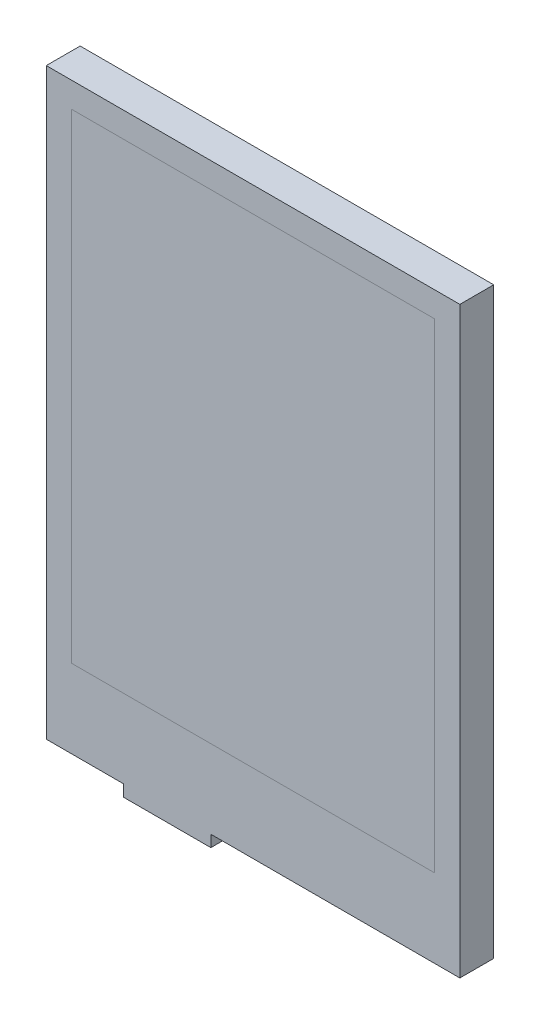
ISO-10303-21;
HEADER;
FILE_DESCRIPTION(('STEP AP214'),'2;1');
FILE_NAME('part.step','',(''),(''),'','','');
FILE_SCHEMA(('AUTOMOTIVE_DESIGN { 1 0 10303 214 1 1 1 1 }'));
ENDSEC;
DATA;
#1=APPLICATION_CONTEXT('core data for automotive mechanical design processes');
#2=APPLICATION_PROTOCOL_DEFINITION('international standard','automotive_design',2000,#1);
#3=PRODUCT_CONTEXT('',#1,'mechanical');
#4=PRODUCT('Part','Part','',(#3));
#5=PRODUCT_RELATED_PRODUCT_CATEGORY('part','',(#4));
#6=PRODUCT_DEFINITION_FORMATION('','',#4);
#7=PRODUCT_DEFINITION_CONTEXT('part definition',#1,'design');
#8=PRODUCT_DEFINITION('design','',#6,#7);
#9=PRODUCT_DEFINITION_SHAPE('','',#8);
#10=(LENGTH_UNIT() NAMED_UNIT(*) SI_UNIT(.MILLI.,.METRE.));
#11=(NAMED_UNIT(*) PLANE_ANGLE_UNIT() SI_UNIT($,.RADIAN.));
#12=(NAMED_UNIT(*) SI_UNIT($,.STERADIAN.) SOLID_ANGLE_UNIT());
#13=UNCERTAINTY_MEASURE_WITH_UNIT(LENGTH_MEASURE(1.E-05),#10,'distance_accuracy_value','');
#14=(GEOMETRIC_REPRESENTATION_CONTEXT(3) GLOBAL_UNCERTAINTY_ASSIGNED_CONTEXT((#13)) GLOBAL_UNIT_ASSIGNED_CONTEXT((#10,
#11,#12)) REPRESENTATION_CONTEXT('',''));
#15=CARTESIAN_POINT('',(0.,0.,0.));
#16=DIRECTION('',(0.,0.,1.));
#17=DIRECTION('',(1.,0.,0.));
#18=AXIS2_PLACEMENT_3D('',#15,#16,#17);
#19=CARTESIAN_POINT('',(-13.1,0.,0.3));
#20=DIRECTION('',(1.,0.,0.));
#21=DIRECTION('',(0.,1.,0.));
#22=AXIS2_PLACEMENT_3D('',#19,#20,#21);
#23=PLANE('',#22);
#24=DIRECTION('',(0.,-1.,0.));
#25=VECTOR('',#24,1.);
#26=CARTESIAN_POINT('',(-13.1,0.,0.));
#27=LINE('',#26,#25);
#28=CARTESIAN_POINT('',(-13.1,0.019999999999995,0.));
#29=VERTEX_POINT('',#28);
#30=CARTESIAN_POINT('',(-13.1,-9.48000000000001,0.));
#31=VERTEX_POINT('',#30);
#32=EDGE_CURVE('E110',#29,#31,#27,.T.);
#33=ORIENTED_EDGE('',*,*,#32,.F.);
#34=DIRECTION('',(0.,0.,-1.));
#35=VECTOR('',#34,1.);
#36=CARTESIAN_POINT('',(-13.1,0.019999999999995,0.3));
#37=LINE('',#36,#35);
#38=CARTESIAN_POINT('',(-13.1,0.019999999999995,0.3));
#39=VERTEX_POINT('',#38);
#40=EDGE_CURVE('E12',#39,#29,#37,.T.);
#41=ORIENTED_EDGE('',*,*,#40,.F.);
#42=DIRECTION('',(0.,-1.,0.));
#43=VECTOR('',#42,1.);
#44=CARTESIAN_POINT('',(-13.1,0.,0.3));
#45=LINE('',#44,#43);
#46=CARTESIAN_POINT('',(-13.1,-9.48000000000001,0.3));
#47=VERTEX_POINT('',#46);
#48=EDGE_CURVE('E98',#39,#47,#45,.T.);
#49=ORIENTED_EDGE('',*,*,#48,.T.);
#50=DIRECTION('',(0.,0.,-1.));
#51=VECTOR('',#50,1.);
#52=CARTESIAN_POINT('',(-13.1,-9.48000000000001,0.3));
#53=LINE('',#52,#51);
#54=EDGE_CURVE('E87',#47,#31,#53,.T.);
#55=ORIENTED_EDGE('',*,*,#54,.T.);
#56=EDGE_LOOP('',(#33,#41,#49,#55));
#57=FACE_BOUND('',#56,.T.);
#58=ADVANCED_FACE('F48',(#57),#23,.T.);
#59=CARTESIAN_POINT('',(0.,0.0199999999999966,0.3));
#60=DIRECTION('',(0.,-1.,0.));
#61=DIRECTION('',(1.,0.,0.));
#62=AXIS2_PLACEMENT_3D('',#59,#60,#61);
#63=PLANE('',#62);
#64=DIRECTION('',(-1.,0.,0.));
#65=VECTOR('',#64,1.);
#66=CARTESIAN_POINT('',(0.,0.0199999999999966,0.));
#67=LINE('',#66,#65);
#68=CARTESIAN_POINT('',(-17.,0.0199999999999945,0.));
#69=VERTEX_POINT('',#68);
#70=EDGE_CURVE('E103',#29,#69,#67,.T.);
#71=ORIENTED_EDGE('',*,*,#70,.T.);
#72=DIRECTION('',(0.,0.,-1.));
#73=VECTOR('',#72,1.);
#74=CARTESIAN_POINT('',(-17.,0.0199999999999945,0.3));
#75=LINE('',#74,#73);
#76=CARTESIAN_POINT('',(-17.,0.0199999999999945,0.3));
#77=VERTEX_POINT('',#76);
#78=EDGE_CURVE('E56',#77,#69,#75,.T.);
#79=ORIENTED_EDGE('',*,*,#78,.F.);
#80=DIRECTION('',(-1.,0.,0.));
#81=VECTOR('',#80,1.);
#82=CARTESIAN_POINT('',(0.,0.0199999999999966,0.3));
#83=LINE('',#82,#81);
#84=EDGE_CURVE('E93',#39,#77,#83,.T.);
#85=ORIENTED_EDGE('',*,*,#84,.F.);
#86=ORIENTED_EDGE('',*,*,#40,.T.);
#87=EDGE_LOOP('',(#71,#79,#85,#86));
#88=FACE_BOUND('',#87,.T.);
#89=ADVANCED_FACE('F101',(#88),#63,.F.);
#90=CARTESIAN_POINT('',(-17.,0.,0.3));
#91=DIRECTION('',(1.,0.,0.));
#92=DIRECTION('',(0.,1.,0.));
#93=AXIS2_PLACEMENT_3D('',#90,#91,#92);
#94=PLANE('',#93);
#95=DIRECTION('',(0.,-1.,0.));
#96=VECTOR('',#95,1.);
#97=CARTESIAN_POINT('',(-17.,0.,0.));
#98=LINE('',#97,#96);
#99=CARTESIAN_POINT('',(-17.,-9.48000000000001,0.));
#100=VERTEX_POINT('',#99);
#101=EDGE_CURVE('E80',#69,#100,#98,.T.);
#102=ORIENTED_EDGE('',*,*,#101,.T.);
#103=DIRECTION('',(0.,0.,-1.));
#104=VECTOR('',#103,1.);
#105=CARTESIAN_POINT('',(-17.,-9.48000000000001,0.3));
#106=LINE('',#105,#104);
#107=CARTESIAN_POINT('',(-17.,-9.48000000000001,0.3));
#108=VERTEX_POINT('',#107);
#109=EDGE_CURVE('E104',#108,#100,#106,.T.);
#110=ORIENTED_EDGE('',*,*,#109,.F.);
#111=DIRECTION('',(0.,-1.,0.));
#112=VECTOR('',#111,1.);
#113=CARTESIAN_POINT('',(-17.,0.,0.3));
#114=LINE('',#113,#112);
#115=EDGE_CURVE('E97',#77,#108,#114,.T.);
#116=ORIENTED_EDGE('',*,*,#115,.F.);
#117=ORIENTED_EDGE('',*,*,#78,.T.);
#118=EDGE_LOOP('',(#102,#110,#116,#117));
#119=FACE_BOUND('',#118,.T.);
#120=ADVANCED_FACE('F105',(#119),#94,.F.);
#121=CARTESIAN_POINT('',(0.,-9.48000000000001,0.3));
#122=DIRECTION('',(0.,1.,0.));
#123=DIRECTION('',(-1.,0.,0.));
#124=AXIS2_PLACEMENT_3D('',#121,#122,#123);
#125=PLANE('',#124);
#126=DIRECTION('',(1.,0.,0.));
#127=VECTOR('',#126,1.);
#128=CARTESIAN_POINT('',(0.,-9.48000000000001,0.));
#129=LINE('',#128,#127);
#130=EDGE_CURVE('E115',#100,#31,#129,.T.);
#131=ORIENTED_EDGE('',*,*,#130,.T.);
#132=ORIENTED_EDGE('',*,*,#54,.F.);
#133=DIRECTION('',(1.,0.,0.));
#134=VECTOR('',#133,1.);
#135=CARTESIAN_POINT('',(0.,-9.48000000000001,0.3));
#136=LINE('',#135,#134);
#137=EDGE_CURVE('E64',#108,#47,#136,.T.);
#138=ORIENTED_EDGE('',*,*,#137,.F.);
#139=ORIENTED_EDGE('',*,*,#109,.T.);
#140=EDGE_LOOP('',(#131,#132,#138,#139));
#141=FACE_BOUND('',#140,.T.);
#142=ADVANCED_FACE('F120',(#141),#125,.F.);
#143=CARTESIAN_POINT('',(0.,0.,0.3));
#144=DIRECTION('',(0.,0.,1.));
#145=DIRECTION('',(1.,0.,0.));
#146=AXIS2_PLACEMENT_3D('',#143,#144,#145);
#147=PLANE('',#146);
#148=ORIENTED_EDGE('',*,*,#48,.F.);
#149=ORIENTED_EDGE('',*,*,#84,.T.);
#150=ORIENTED_EDGE('',*,*,#115,.T.);
#151=ORIENTED_EDGE('',*,*,#137,.T.);
#152=EDGE_LOOP('',(#148,#149,#150,#151));
#153=FACE_BOUND('',#152,.T.);
#154=ADVANCED_FACE('F95',(#153),#147,.T.);
#155=CARTESIAN_POINT('',(0.,0.,0.));
#156=DIRECTION('',(0.,0.,1.));
#157=DIRECTION('',(1.,0.,0.));
#158=AXIS2_PLACEMENT_3D('',#155,#156,#157);
#159=PLANE('',#158);
#160=ORIENTED_EDGE('',*,*,#32,.T.);
#161=ORIENTED_EDGE('',*,*,#130,.F.);
#162=ORIENTED_EDGE('',*,*,#101,.F.);
#163=ORIENTED_EDGE('',*,*,#70,.F.);
#164=EDGE_LOOP('',(#160,#161,#162,#163));
#165=FACE_BOUND('',#164,.T.);
#166=ADVANCED_FACE('F122',(#165),#159,.F.);
#167=CLOSED_SHELL('',(#58,#89,#120,#142,#154,#166));
#168=MANIFOLD_SOLID_BREP('B2',#167);
#169=CARTESIAN_POINT('',(0.,24.78,3.5));
#170=DIRECTION('',(0.,-1.,0.));
#171=DIRECTION('',(0.,0.,-1.));
#172=AXIS2_PLACEMENT_3D('',#169,#170,#171);
#173=PLANE('',#172);
#174=DIRECTION('',(-1.,0.,0.));
#175=VECTOR('',#174,1.);
#176=CARTESIAN_POINT('',(0.,24.78,0.));
#177=LINE('',#176,#175);
#178=CARTESIAN_POINT('',(18.76,24.78,0.));
#179=VERTEX_POINT('',#178);
#180=CARTESIAN_POINT('',(-18.76,24.78,0.));
#181=VERTEX_POINT('',#180);
#182=EDGE_CURVE('E263',#179,#181,#177,.T.);
#183=ORIENTED_EDGE('',*,*,#182,.T.);
#184=DIRECTION('',(0.,0.,-1.));
#185=VECTOR('',#184,1.);
#186=CARTESIAN_POINT('',(-18.76,24.78,3.5));
#187=LINE('',#186,#185);
#188=CARTESIAN_POINT('',(-18.76,24.78,3.5));
#189=VERTEX_POINT('',#188);
#190=EDGE_CURVE('E46',#189,#181,#187,.T.);
#191=ORIENTED_EDGE('',*,*,#190,.F.);
#192=DIRECTION('',(-1.,0.,0.));
#193=VECTOR('',#192,1.);
#194=CARTESIAN_POINT('',(0.,24.78,3.5));
#195=LINE('',#194,#193);
#196=CARTESIAN_POINT('',(18.76,24.78,3.5));
#197=VERTEX_POINT('',#196);
#198=EDGE_CURVE('E293',#197,#189,#195,.T.);
#199=ORIENTED_EDGE('',*,*,#198,.F.);
#200=DIRECTION('',(0.,0.,-1.));
#201=VECTOR('',#200,1.);
#202=CARTESIAN_POINT('',(18.76,24.78,3.5));
#203=LINE('',#202,#201);
#204=EDGE_CURVE('E206',#197,#179,#203,.T.);
#205=ORIENTED_EDGE('',*,*,#204,.T.);
#206=EDGE_LOOP('',(#183,#191,#199,#205));
#207=FACE_BOUND('',#206,.T.);
#208=ADVANCED_FACE('F183',(#207),#173,.F.);
#209=CARTESIAN_POINT('',(-18.76,0.,3.5));
#210=DIRECTION('',(1.,0.,0.));
#211=DIRECTION('',(0.,0.,-1.));
#212=AXIS2_PLACEMENT_3D('',#209,#210,#211);
#213=PLANE('',#212);
#214=DIRECTION('',(0.,-1.,0.));
#215=VECTOR('',#214,1.);
#216=CARTESIAN_POINT('',(-18.76,0.,0.));
#217=LINE('',#216,#215);
#218=CARTESIAN_POINT('',(-18.76,-24.78,0.));
#219=VERTEX_POINT('',#218);
#220=EDGE_CURVE('E303',#181,#219,#217,.T.);
#221=ORIENTED_EDGE('',*,*,#220,.T.);
#222=DIRECTION('',(0.,0.,-1.));
#223=VECTOR('',#222,1.);
#224=CARTESIAN_POINT('',(-18.76,-24.78,3.5));
#225=LINE('',#224,#223);
#226=CARTESIAN_POINT('',(-18.76,-24.78,3.5));
#227=VERTEX_POINT('',#226);
#228=EDGE_CURVE('E190',#227,#219,#225,.T.);
#229=ORIENTED_EDGE('',*,*,#228,.F.);
#230=DIRECTION('',(0.,-1.,0.));
#231=VECTOR('',#230,1.);
#232=CARTESIAN_POINT('',(-18.76,0.,3.5));
#233=LINE('',#232,#231);
#234=EDGE_CURVE('E232',#189,#227,#233,.T.);
#235=ORIENTED_EDGE('',*,*,#234,.F.);
#236=ORIENTED_EDGE('',*,*,#190,.T.);
#237=EDGE_LOOP('',(#221,#229,#235,#236));
#238=FACE_BOUND('',#237,.T.);
#239=ADVANCED_FACE('F317',(#238),#213,.F.);
#240=CARTESIAN_POINT('',(0.,-24.78,3.5));
#241=DIRECTION('',(0.,-1.,0.));
#242=DIRECTION('',(0.,0.,-1.));
#243=AXIS2_PLACEMENT_3D('',#240,#241,#242);
#244=PLANE('',#243);
#245=DIRECTION('',(-1.,0.,0.));
#246=VECTOR('',#245,1.);
#247=CARTESIAN_POINT('',(0.,-24.78,0.));
#248=LINE('',#247,#246);
#249=CARTESIAN_POINT('',(18.76,-24.78,0.));
#250=VERTEX_POINT('',#249);
#251=EDGE_CURVE('E306',#250,#219,#248,.T.);
#252=ORIENTED_EDGE('',*,*,#251,.F.);
#253=DIRECTION('',(0.,0.,-1.));
#254=VECTOR('',#253,1.);
#255=CARTESIAN_POINT('',(18.76,-24.78,3.5));
#256=LINE('',#255,#254);
#257=CARTESIAN_POINT('',(18.76,-24.78,3.5));
#258=VERTEX_POINT('',#257);
#259=EDGE_CURVE('E312',#258,#250,#256,.T.);
#260=ORIENTED_EDGE('',*,*,#259,.F.);
#261=DIRECTION('',(-1.,0.,0.));
#262=VECTOR('',#261,1.);
#263=CARTESIAN_POINT('',(0.,-24.78,3.5));
#264=LINE('',#263,#262);
#265=EDGE_CURVE('E297',#258,#227,#264,.T.);
#266=ORIENTED_EDGE('',*,*,#265,.T.);
#267=ORIENTED_EDGE('',*,*,#228,.T.);
#268=EDGE_LOOP('',(#252,#260,#266,#267));
#269=FACE_BOUND('',#268,.T.);
#270=ADVANCED_FACE('F315',(#269),#244,.T.);
#271=CARTESIAN_POINT('',(18.76,0.,3.5));
#272=DIRECTION('',(1.,0.,0.));
#273=DIRECTION('',(0.,0.,-1.));
#274=AXIS2_PLACEMENT_3D('',#271,#272,#273);
#275=PLANE('',#274);
#276=DIRECTION('',(0.,-1.,0.));
#277=VECTOR('',#276,1.);
#278=CARTESIAN_POINT('',(18.76,0.,0.));
#279=LINE('',#278,#277);
#280=EDGE_CURVE('E295',#179,#250,#279,.T.);
#281=ORIENTED_EDGE('',*,*,#280,.F.);
#282=ORIENTED_EDGE('',*,*,#204,.F.);
#283=DIRECTION('',(0.,-1.,0.));
#284=VECTOR('',#283,1.);
#285=CARTESIAN_POINT('',(18.76,0.,3.5));
#286=LINE('',#285,#284);
#287=EDGE_CURVE('E300',#197,#258,#286,.T.);
#288=ORIENTED_EDGE('',*,*,#287,.T.);
#289=ORIENTED_EDGE('',*,*,#259,.T.);
#290=EDGE_LOOP('',(#281,#282,#288,#289));
#291=FACE_BOUND('',#290,.T.);
#292=ADVANCED_FACE('F321',(#291),#275,.T.);
#293=CARTESIAN_POINT('',(0.,0.,3.5));
#294=DIRECTION('',(0.,0.,1.));
#295=DIRECTION('',(1.,0.,0.));
#296=AXIS2_PLACEMENT_3D('',#293,#294,#295);
#297=PLANE('',#296);
#298=ORIENTED_EDGE('',*,*,#198,.T.);
#299=ORIENTED_EDGE('',*,*,#234,.T.);
#300=ORIENTED_EDGE('',*,*,#265,.F.);
#301=ORIENTED_EDGE('',*,*,#287,.F.);
#302=EDGE_LOOP('',(#298,#299,#300,#301));
#303=FACE_BOUND('',#302,.T.);
#304=ADVANCED_FACE('F324',(#303),#297,.T.);
#305=CARTESIAN_POINT('',(0.,0.,0.));
#306=DIRECTION('',(0.,0.,1.));
#307=DIRECTION('',(1.,0.,0.));
#308=AXIS2_PLACEMENT_3D('',#305,#306,#307);
#309=PLANE('',#308);
#310=DIRECTION('',(1.,0.,0.));
#311=VECTOR('',#310,1.);
#312=CARTESIAN_POINT('',(0.,-9.48000000000001,0.));
#313=LINE('',#312,#311);
#314=CARTESIAN_POINT('',(-17.,-9.48000000000001,0.));
#315=VERTEX_POINT('',#314);
#316=CARTESIAN_POINT('',(-13.1,-9.48000000000001,0.));
#317=VERTEX_POINT('',#316);
#318=EDGE_CURVE('E276',#315,#317,#313,.T.);
#319=ORIENTED_EDGE('',*,*,#318,.T.);
#320=DIRECTION('',(0.,-1.,0.));
#321=VECTOR('',#320,1.);
#322=CARTESIAN_POINT('',(-13.1,0.,0.));
#323=LINE('',#322,#321);
#324=CARTESIAN_POINT('',(-13.1,0.019999999999995,0.));
#325=VERTEX_POINT('',#324);
#326=EDGE_CURVE('E197',#325,#317,#323,.T.);
#327=ORIENTED_EDGE('',*,*,#326,.F.);
#328=DIRECTION('',(-1.,0.,0.));
#329=VECTOR('',#328,1.);
#330=CARTESIAN_POINT('',(0.,0.0199999999999966,0.));
#331=LINE('',#330,#329);
#332=CARTESIAN_POINT('',(-17.,0.0199999999999945,0.));
#333=VERTEX_POINT('',#332);
#334=EDGE_CURVE('E261',#325,#333,#331,.T.);
#335=ORIENTED_EDGE('',*,*,#334,.T.);
#336=DIRECTION('',(0.,-1.,0.));
#337=VECTOR('',#336,1.);
#338=CARTESIAN_POINT('',(-17.,0.,0.));
#339=LINE('',#338,#337);
#340=EDGE_CURVE('E279',#333,#315,#339,.T.);
#341=ORIENTED_EDGE('',*,*,#340,.T.);
#342=EDGE_LOOP('',(#319,#327,#335,#341));
#343=FACE_BOUND('',#342,.T.);
#344=ORIENTED_EDGE('',*,*,#182,.F.);
#345=ORIENTED_EDGE('',*,*,#280,.T.);
#346=ORIENTED_EDGE('',*,*,#251,.T.);
#347=ORIENTED_EDGE('',*,*,#220,.F.);
#348=EDGE_LOOP('',(#344,#345,#346,#347));
#349=FACE_BOUND('',#348,.T.);
#350=ADVANCED_FACE('F320',(#343,#349),#309,.F.);
#351=CARTESIAN_POINT('',(-13.1,0.,0.3));
#352=DIRECTION('',(1.,0.,0.));
#353=DIRECTION('',(0.,1.,0.));
#354=AXIS2_PLACEMENT_3D('',#351,#352,#353);
#355=PLANE('',#354);
#356=ORIENTED_EDGE('',*,*,#326,.T.);
#357=DIRECTION('',(0.,0.,-1.));
#358=VECTOR('',#357,1.);
#359=CARTESIAN_POINT('',(-13.1,-9.48000000000001,0.3));
#360=LINE('',#359,#358);
#361=CARTESIAN_POINT('',(-13.1,-9.48000000000001,0.3));
#362=VERTEX_POINT('',#361);
#363=EDGE_CURVE('E275',#362,#317,#360,.T.);
#364=ORIENTED_EDGE('',*,*,#363,.F.);
#365=DIRECTION('',(0.,-1.,0.));
#366=VECTOR('',#365,1.);
#367=CARTESIAN_POINT('',(-13.1,0.,0.3));
#368=LINE('',#367,#366);
#369=CARTESIAN_POINT('',(-13.1,0.019999999999995,0.3));
#370=VERTEX_POINT('',#369);
#371=EDGE_CURVE('E271',#370,#362,#368,.T.);
#372=ORIENTED_EDGE('',*,*,#371,.F.);
#373=DIRECTION('',(0.,0.,-1.));
#374=VECTOR('',#373,1.);
#375=CARTESIAN_POINT('',(-13.1,0.019999999999995,0.3));
#376=LINE('',#375,#374);
#377=EDGE_CURVE('E255',#370,#325,#376,.T.);
#378=ORIENTED_EDGE('',*,*,#377,.T.);
#379=EDGE_LOOP('',(#356,#364,#372,#378));
#380=FACE_BOUND('',#379,.T.);
#381=ADVANCED_FACE('F274',(#380),#355,.F.);
#382=CARTESIAN_POINT('',(0.,0.0199999999999966,0.3));
#383=DIRECTION('',(0.,-1.,0.));
#384=DIRECTION('',(1.,0.,0.));
#385=AXIS2_PLACEMENT_3D('',#382,#383,#384);
#386=PLANE('',#385);
#387=ORIENTED_EDGE('',*,*,#334,.F.);
#388=ORIENTED_EDGE('',*,*,#377,.F.);
#389=DIRECTION('',(-1.,0.,0.));
#390=VECTOR('',#389,1.);
#391=CARTESIAN_POINT('',(0.,0.0199999999999966,0.3));
#392=LINE('',#391,#390);
#393=CARTESIAN_POINT('',(-17.,0.0199999999999945,0.3));
#394=VERTEX_POINT('',#393);
#395=EDGE_CURVE('E258',#370,#394,#392,.T.);
#396=ORIENTED_EDGE('',*,*,#395,.T.);
#397=DIRECTION('',(0.,0.,-1.));
#398=VECTOR('',#397,1.);
#399=CARTESIAN_POINT('',(-17.,0.0199999999999945,0.3));
#400=LINE('',#399,#398);
#401=EDGE_CURVE('E264',#394,#333,#400,.T.);
#402=ORIENTED_EDGE('',*,*,#401,.T.);
#403=EDGE_LOOP('',(#387,#388,#396,#402));
#404=FACE_BOUND('',#403,.T.);
#405=ADVANCED_FACE('F257',(#404),#386,.T.);
#406=CARTESIAN_POINT('',(-17.,0.,0.3));
#407=DIRECTION('',(1.,0.,0.));
#408=DIRECTION('',(0.,1.,0.));
#409=AXIS2_PLACEMENT_3D('',#406,#407,#408);
#410=PLANE('',#409);
#411=ORIENTED_EDGE('',*,*,#340,.F.);
#412=ORIENTED_EDGE('',*,*,#401,.F.);
#413=DIRECTION('',(0.,-1.,0.));
#414=VECTOR('',#413,1.);
#415=CARTESIAN_POINT('',(-17.,0.,0.3));
#416=LINE('',#415,#414);
#417=CARTESIAN_POINT('',(-17.,-9.48000000000001,0.3));
#418=VERTEX_POINT('',#417);
#419=EDGE_CURVE('E272',#394,#418,#416,.T.);
#420=ORIENTED_EDGE('',*,*,#419,.T.);
#421=DIRECTION('',(0.,0.,-1.));
#422=VECTOR('',#421,1.);
#423=CARTESIAN_POINT('',(-17.,-9.48000000000001,0.3));
#424=LINE('',#423,#422);
#425=EDGE_CURVE('E290',#418,#315,#424,.T.);
#426=ORIENTED_EDGE('',*,*,#425,.T.);
#427=EDGE_LOOP('',(#411,#412,#420,#426));
#428=FACE_BOUND('',#427,.T.);
#429=ADVANCED_FACE('F345',(#428),#410,.T.);
#430=CARTESIAN_POINT('',(0.,-9.48000000000001,0.3));
#431=DIRECTION('',(0.,1.,0.));
#432=DIRECTION('',(-1.,0.,0.));
#433=AXIS2_PLACEMENT_3D('',#430,#431,#432);
#434=PLANE('',#433);
#435=ORIENTED_EDGE('',*,*,#318,.F.);
#436=ORIENTED_EDGE('',*,*,#425,.F.);
#437=DIRECTION('',(1.,0.,0.));
#438=VECTOR('',#437,1.);
#439=CARTESIAN_POINT('',(0.,-9.48000000000001,0.3));
#440=LINE('',#439,#438);
#441=EDGE_CURVE('E283',#418,#362,#440,.T.);
#442=ORIENTED_EDGE('',*,*,#441,.T.);
#443=ORIENTED_EDGE('',*,*,#363,.T.);
#444=EDGE_LOOP('',(#435,#436,#442,#443));
#445=FACE_BOUND('',#444,.T.);
#446=ADVANCED_FACE('F348',(#445),#434,.T.);
#447=CARTESIAN_POINT('',(0.,0.,0.3));
#448=DIRECTION('',(0.,0.,1.));
#449=DIRECTION('',(1.,0.,0.));
#450=AXIS2_PLACEMENT_3D('',#447,#448,#449);
#451=PLANE('',#450);
#452=ORIENTED_EDGE('',*,*,#371,.T.);
#453=ORIENTED_EDGE('',*,*,#441,.F.);
#454=ORIENTED_EDGE('',*,*,#419,.F.);
#455=ORIENTED_EDGE('',*,*,#395,.F.);
#456=EDGE_LOOP('',(#452,#453,#454,#455));
#457=FACE_BOUND('',#456,.T.);
#458=ADVANCED_FACE('F269',(#457),#451,.F.);
#459=CLOSED_SHELL('',(#208,#239,#270,#292,#304,#350,#381,#405,#429,#446,#458));
#460=MANIFOLD_SOLID_BREP('B6',#459);
#461=CARTESIAN_POINT('',(0.,27.38,3.5));
#462=DIRECTION('',(0.,-1.,0.));
#463=DIRECTION('',(0.,0.,-1.));
#464=AXIS2_PLACEMENT_3D('',#461,#462,#463);
#465=PLANE('',#464);
#466=DIRECTION('',(-1.,0.,0.));
#467=VECTOR('',#466,1.);
#468=CARTESIAN_POINT('',(0.,27.38,0.));
#469=LINE('',#468,#467);
#470=CARTESIAN_POINT('',(21.36,27.38,0.));
#471=VERTEX_POINT('',#470);
#472=CARTESIAN_POINT('',(-21.36,27.38,0.));
#473=VERTEX_POINT('',#472);
#474=EDGE_CURVE('E616',#471,#473,#469,.T.);
#475=ORIENTED_EDGE('',*,*,#474,.T.);
#476=DIRECTION('',(0.,0.,-1.));
#477=VECTOR('',#476,1.);
#478=CARTESIAN_POINT('',(-21.36,27.38,3.5));
#479=LINE('',#478,#477);
#480=CARTESIAN_POINT('',(-21.36,27.38,3.5));
#481=VERTEX_POINT('',#480);
#482=EDGE_CURVE('E181',#481,#473,#479,.T.);
#483=ORIENTED_EDGE('',*,*,#482,.F.);
#484=DIRECTION('',(-1.,0.,0.));
#485=VECTOR('',#484,1.);
#486=CARTESIAN_POINT('',(0.,27.38,3.5));
#487=LINE('',#486,#485);
#488=CARTESIAN_POINT('',(21.36,27.38,3.5));
#489=VERTEX_POINT('',#488);
#490=EDGE_CURVE('E559',#489,#481,#487,.T.);
#491=ORIENTED_EDGE('',*,*,#490,.F.);
#492=DIRECTION('',(0.,0.,-1.));
#493=VECTOR('',#492,1.);
#494=CARTESIAN_POINT('',(21.36,27.38,3.5));
#495=LINE('',#494,#493);
#496=EDGE_CURVE('E445',#489,#471,#495,.T.);
#497=ORIENTED_EDGE('',*,*,#496,.T.);
#498=EDGE_LOOP('',(#475,#483,#491,#497));
#499=FACE_BOUND('',#498,.T.);
#500=ADVANCED_FACE('F426',(#499),#465,.F.);
#501=CARTESIAN_POINT('',(-21.36,0.,3.5));
#502=DIRECTION('',(1.,0.,0.));
#503=DIRECTION('',(0.,0.,-1.));
#504=AXIS2_PLACEMENT_3D('',#501,#502,#503);
#505=PLANE('',#504);
#506=DIRECTION('',(0.,-1.,0.));
#507=VECTOR('',#506,1.);
#508=CARTESIAN_POINT('',(-21.36,0.,0.));
#509=LINE('',#508,#507);
#510=CARTESIAN_POINT('',(-21.36,-32.88,0.));
#511=VERTEX_POINT('',#510);
#512=EDGE_CURVE('E618',#473,#511,#509,.T.);
#513=ORIENTED_EDGE('',*,*,#512,.T.);
#514=DIRECTION('',(0.,0.,-1.));
#515=VECTOR('',#514,1.);
#516=CARTESIAN_POINT('',(-21.36,-32.88,3.5));
#517=LINE('',#516,#515);
#518=CARTESIAN_POINT('',(-21.36,-32.88,3.5));
#519=VERTEX_POINT('',#518);
#520=EDGE_CURVE('E436',#519,#511,#517,.T.);
#521=ORIENTED_EDGE('',*,*,#520,.F.);
#522=DIRECTION('',(0.,-1.,0.));
#523=VECTOR('',#522,1.);
#524=CARTESIAN_POINT('',(-21.36,0.,3.5));
#525=LINE('',#524,#523);
#526=EDGE_CURVE('E555',#481,#519,#525,.T.);
#527=ORIENTED_EDGE('',*,*,#526,.F.);
#528=ORIENTED_EDGE('',*,*,#482,.T.);
#529=EDGE_LOOP('',(#513,#521,#527,#528));
#530=FACE_BOUND('',#529,.T.);
#531=ADVANCED_FACE('F636',(#530),#505,.F.);
#532=CARTESIAN_POINT('',(0.,-32.88,3.5));
#533=DIRECTION('',(0.,-1.,0.));
#534=DIRECTION('',(0.,0.,-1.));
#535=AXIS2_PLACEMENT_3D('',#532,#533,#534);
#536=PLANE('',#535);
#537=DIRECTION('',(-1.,0.,0.));
#538=VECTOR('',#537,1.);
#539=CARTESIAN_POINT('',(0.,-32.88,0.));
#540=LINE('',#539,#538);
#541=CARTESIAN_POINT('',(-13.36,-32.88,0.));
#542=VERTEX_POINT('',#541);
#543=EDGE_CURVE('E577',#542,#511,#540,.T.);
#544=ORIENTED_EDGE('',*,*,#543,.F.);
#545=DIRECTION('',(0.,0.,-1.));
#546=VECTOR('',#545,1.);
#547=CARTESIAN_POINT('',(-13.36,-32.88,3.5));
#548=LINE('',#547,#546);
#549=CARTESIAN_POINT('',(-13.36,-32.88,3.5));
#550=VERTEX_POINT('',#549);
#551=EDGE_CURVE('E586',#550,#542,#548,.T.);
#552=ORIENTED_EDGE('',*,*,#551,.F.);
#553=DIRECTION('',(-1.,0.,0.));
#554=VECTOR('',#553,1.);
#555=CARTESIAN_POINT('',(0.,-32.88,3.5));
#556=LINE('',#555,#554);
#557=EDGE_CURVE('E548',#550,#519,#556,.T.);
#558=ORIENTED_EDGE('',*,*,#557,.T.);
#559=ORIENTED_EDGE('',*,*,#520,.T.);
#560=EDGE_LOOP('',(#544,#552,#558,#559));
#561=FACE_BOUND('',#560,.T.);
#562=ADVANCED_FACE('F633',(#561),#536,.T.);
#563=CARTESIAN_POINT('',(-13.36,0.,3.5));
#564=DIRECTION('',(-1.,0.,0.));
#565=DIRECTION('',(0.,0.,1.));
#566=AXIS2_PLACEMENT_3D('',#563,#564,#565);
#567=PLANE('',#566);
#568=DIRECTION('',(0.,1.,0.));
#569=VECTOR('',#568,1.);
#570=CARTESIAN_POINT('',(-13.36,0.,0.));
#571=LINE('',#570,#569);
#572=CARTESIAN_POINT('',(-13.36,-34.08,0.));
#573=VERTEX_POINT('',#572);
#574=EDGE_CURVE('E622',#573,#542,#571,.T.);
#575=ORIENTED_EDGE('',*,*,#574,.F.);
#576=DIRECTION('',(0.,0.,-1.));
#577=VECTOR('',#576,1.);
#578=CARTESIAN_POINT('',(-13.36,-34.08,3.5));
#579=LINE('',#578,#577);
#580=CARTESIAN_POINT('',(-13.36,-34.08,3.5));
#581=VERTEX_POINT('',#580);
#582=EDGE_CURVE('E584',#581,#573,#579,.T.);
#583=ORIENTED_EDGE('',*,*,#582,.F.);
#584=DIRECTION('',(0.,1.,0.));
#585=VECTOR('',#584,1.);
#586=CARTESIAN_POINT('',(-13.36,0.,3.5));
#587=LINE('',#586,#585);
#588=EDGE_CURVE('E554',#581,#550,#587,.T.);
#589=ORIENTED_EDGE('',*,*,#588,.T.);
#590=ORIENTED_EDGE('',*,*,#551,.T.);
#591=EDGE_LOOP('',(#575,#583,#589,#590));
#592=FACE_BOUND('',#591,.T.);
#593=ADVANCED_FACE('F631',(#592),#567,.T.);
#594=CARTESIAN_POINT('',(0.,-34.08,3.5));
#595=DIRECTION('',(0.,-1.,0.));
#596=DIRECTION('',(0.,0.,-1.));
#597=AXIS2_PLACEMENT_3D('',#594,#595,#596);
#598=PLANE('',#597);
#599=DIRECTION('',(-1.,0.,0.));
#600=VECTOR('',#599,1.);
#601=CARTESIAN_POINT('',(0.,-34.08,0.));
#602=LINE('',#601,#600);
#603=CARTESIAN_POINT('',(-4.36,-34.08,0.));
#604=VERTEX_POINT('',#603);
#605=EDGE_CURVE('E624',#604,#573,#602,.T.);
#606=ORIENTED_EDGE('',*,*,#605,.F.);
#607=DIRECTION('',(0.,0.,-1.));
#608=VECTOR('',#607,1.);
#609=CARTESIAN_POINT('',(-4.36,-34.08,3.5));
#610=LINE('',#609,#608);
#611=CARTESIAN_POINT('',(-4.36,-34.08,3.5));
#612=VERTEX_POINT('',#611);
#613=EDGE_CURVE('E543',#612,#604,#610,.T.);
#614=ORIENTED_EDGE('',*,*,#613,.F.);
#615=DIRECTION('',(-1.,0.,0.));
#616=VECTOR('',#615,1.);
#617=CARTESIAN_POINT('',(0.,-34.08,3.5));
#618=LINE('',#617,#616);
#619=EDGE_CURVE('E533',#612,#581,#618,.T.);
#620=ORIENTED_EDGE('',*,*,#619,.T.);
#621=ORIENTED_EDGE('',*,*,#582,.T.);
#622=EDGE_LOOP('',(#606,#614,#620,#621));
#623=FACE_BOUND('',#622,.T.);
#624=ADVANCED_FACE('F629',(#623),#598,.T.);
#625=CARTESIAN_POINT('',(-4.36,0.,3.5));
#626=DIRECTION('',(-1.,0.,0.));
#627=DIRECTION('',(0.,0.,1.));
#628=AXIS2_PLACEMENT_3D('',#625,#626,#627);
#629=PLANE('',#628);
#630=DIRECTION('',(0.,1.,0.));
#631=VECTOR('',#630,1.);
#632=CARTESIAN_POINT('',(-4.36,0.,0.));
#633=LINE('',#632,#631);
#634=CARTESIAN_POINT('',(-4.36,-32.88,0.));
#635=VERTEX_POINT('',#634);
#636=EDGE_CURVE('E540',#604,#635,#633,.T.);
#637=ORIENTED_EDGE('',*,*,#636,.T.);
#638=DIRECTION('',(0.,0.,-1.));
#639=VECTOR('',#638,1.);
#640=CARTESIAN_POINT('',(-4.36,-32.88,3.5));
#641=LINE('',#640,#639);
#642=CARTESIAN_POINT('',(-4.36,-32.88,3.5));
#643=VERTEX_POINT('',#642);
#644=EDGE_CURVE('E537',#643,#635,#641,.T.);
#645=ORIENTED_EDGE('',*,*,#644,.F.);
#646=DIRECTION('',(0.,1.,0.));
#647=VECTOR('',#646,1.);
#648=CARTESIAN_POINT('',(-4.36,0.,3.5));
#649=LINE('',#648,#647);
#650=EDGE_CURVE('E524',#612,#643,#649,.T.);
#651=ORIENTED_EDGE('',*,*,#650,.F.);
#652=ORIENTED_EDGE('',*,*,#613,.T.);
#653=EDGE_LOOP('',(#637,#645,#651,#652));
#654=FACE_BOUND('',#653,.T.);
#655=ADVANCED_FACE('F538',(#654),#629,.F.);
#656=CARTESIAN_POINT('',(21.36,-32.88,0.));
#657=VERTEX_POINT('',#656);
#658=EDGE_CURVE('E573',#657,#635,#540,.T.);
#659=ORIENTED_EDGE('',*,*,#658,.F.);
#660=DIRECTION('',(0.,0.,-1.));
#661=VECTOR('',#660,1.);
#662=CARTESIAN_POINT('',(21.36,-32.88,3.5));
#663=LINE('',#662,#661);
#664=CARTESIAN_POINT('',(21.36,-32.88,3.5));
#665=VERTEX_POINT('',#664);
#666=EDGE_CURVE('E483',#665,#657,#663,.T.);
#667=ORIENTED_EDGE('',*,*,#666,.F.);
#668=EDGE_CURVE('E530',#665,#643,#556,.T.);
#669=ORIENTED_EDGE('',*,*,#668,.T.);
#670=ORIENTED_EDGE('',*,*,#644,.T.);
#671=EDGE_LOOP('',(#659,#667,#669,#670));
#672=FACE_BOUND('',#671,.T.);
#673=ADVANCED_FACE('F545',(#672),#536,.T.);
#674=CARTESIAN_POINT('',(-18.76,0.,3.5));
#675=DIRECTION('',(1.,0.,0.));
#676=DIRECTION('',(0.,0.,-1.));
#677=AXIS2_PLACEMENT_3D('',#674,#675,#676);
#678=PLANE('',#677);
#679=DIRECTION('',(0.,-1.,0.));
#680=VECTOR('',#679,1.);
#681=CARTESIAN_POINT('',(-18.76,0.,0.));
#682=LINE('',#681,#680);
#683=CARTESIAN_POINT('',(-18.76,24.78,0.));
#684=VERTEX_POINT('',#683);
#685=CARTESIAN_POINT('',(-18.76,-24.78,0.));
#686=VERTEX_POINT('',#685);
#687=EDGE_CURVE('E603',#684,#686,#682,.T.);
#688=ORIENTED_EDGE('',*,*,#687,.F.);
#689=DIRECTION('',(0.,0.,-1.));
#690=VECTOR('',#689,1.);
#691=CARTESIAN_POINT('',(-18.76,24.78,3.5));
#692=LINE('',#691,#690);
#693=CARTESIAN_POINT('',(-18.76,24.78,3.5));
#694=VERTEX_POINT('',#693);
#695=EDGE_CURVE('E430',#694,#684,#692,.T.);
#696=ORIENTED_EDGE('',*,*,#695,.F.);
#697=DIRECTION('',(0.,-1.,0.));
#698=VECTOR('',#697,1.);
#699=CARTESIAN_POINT('',(-18.76,0.,3.5));
#700=LINE('',#699,#698);
#701=CARTESIAN_POINT('',(-18.76,-24.78,3.5));
#702=VERTEX_POINT('',#701);
#703=EDGE_CURVE('E570',#694,#702,#700,.T.);
#704=ORIENTED_EDGE('',*,*,#703,.T.);
#705=DIRECTION('',(0.,0.,-1.));
#706=VECTOR('',#705,1.);
#707=CARTESIAN_POINT('',(-18.76,-24.78,3.5));
#708=LINE('',#707,#706);
#709=EDGE_CURVE('E549',#702,#686,#708,.T.);
#710=ORIENTED_EDGE('',*,*,#709,.T.);
#711=EDGE_LOOP('',(#688,#696,#704,#710));
#712=FACE_BOUND('',#711,.T.);
#713=ADVANCED_FACE('F428',(#712),#678,.T.);
#714=CARTESIAN_POINT('',(0.,24.78,3.5));
#715=DIRECTION('',(0.,-1.,0.));
#716=DIRECTION('',(0.,0.,-1.));
#717=AXIS2_PLACEMENT_3D('',#714,#715,#716);
#718=PLANE('',#717);
#719=DIRECTION('',(-1.,0.,0.));
#720=VECTOR('',#719,1.);
#721=CARTESIAN_POINT('',(0.,24.78,0.));
#722=LINE('',#721,#720);
#723=CARTESIAN_POINT('',(18.76,24.78,0.));
#724=VERTEX_POINT('',#723);
#725=EDGE_CURVE('E600',#724,#684,#722,.T.);
#726=ORIENTED_EDGE('',*,*,#725,.F.);
#727=DIRECTION('',(0.,0.,-1.));
#728=VECTOR('',#727,1.);
#729=CARTESIAN_POINT('',(18.76,24.78,3.5));
#730=LINE('',#729,#728);
#731=CARTESIAN_POINT('',(18.76,24.78,3.5));
#732=VERTEX_POINT('',#731);
#733=EDGE_CURVE('E592',#732,#724,#730,.T.);
#734=ORIENTED_EDGE('',*,*,#733,.F.);
#735=DIRECTION('',(-1.,0.,0.));
#736=VECTOR('',#735,1.);
#737=CARTESIAN_POINT('',(0.,24.78,3.5));
#738=LINE('',#737,#736);
#739=EDGE_CURVE('E567',#732,#694,#738,.T.);
#740=ORIENTED_EDGE('',*,*,#739,.T.);
#741=ORIENTED_EDGE('',*,*,#695,.T.);
#742=EDGE_LOOP('',(#726,#734,#740,#741));
#743=FACE_BOUND('',#742,.T.);
#744=ADVANCED_FACE('F598',(#743),#718,.T.);
#745=CARTESIAN_POINT('',(18.76,0.,3.5));
#746=DIRECTION('',(1.,0.,0.));
#747=DIRECTION('',(0.,0.,-1.));
#748=AXIS2_PLACEMENT_3D('',#745,#746,#747);
#749=PLANE('',#748);
#750=DIRECTION('',(0.,-1.,0.));
#751=VECTOR('',#750,1.);
#752=CARTESIAN_POINT('',(18.76,0.,0.));
#753=LINE('',#752,#751);
#754=CARTESIAN_POINT('',(18.76,-24.78,0.));
#755=VERTEX_POINT('',#754);
#756=EDGE_CURVE('E610',#724,#755,#753,.T.);
#757=ORIENTED_EDGE('',*,*,#756,.T.);
#758=DIRECTION('',(0.,0.,-1.));
#759=VECTOR('',#758,1.);
#760=CARTESIAN_POINT('',(18.76,-24.78,3.5));
#761=LINE('',#760,#759);
#762=CARTESIAN_POINT('',(18.76,-24.78,3.5));
#763=VERTEX_POINT('',#762);
#764=EDGE_CURVE('E590',#763,#755,#761,.T.);
#765=ORIENTED_EDGE('',*,*,#764,.F.);
#766=DIRECTION('',(0.,-1.,0.));
#767=VECTOR('',#766,1.);
#768=CARTESIAN_POINT('',(18.76,0.,3.5));
#769=LINE('',#768,#767);
#770=EDGE_CURVE('E565',#732,#763,#769,.T.);
#771=ORIENTED_EDGE('',*,*,#770,.F.);
#772=ORIENTED_EDGE('',*,*,#733,.T.);
#773=EDGE_LOOP('',(#757,#765,#771,#772));
#774=FACE_BOUND('',#773,.T.);
#775=ADVANCED_FACE('F649',(#774),#749,.F.);
#776=CARTESIAN_POINT('',(0.,-24.78,3.5));
#777=DIRECTION('',(0.,-1.,0.));
#778=DIRECTION('',(0.,0.,-1.));
#779=AXIS2_PLACEMENT_3D('',#776,#777,#778);
#780=PLANE('',#779);
#781=DIRECTION('',(-1.,0.,0.));
#782=VECTOR('',#781,1.);
#783=CARTESIAN_POINT('',(0.,-24.78,0.));
#784=LINE('',#783,#782);
#785=EDGE_CURVE('E612',#755,#686,#784,.T.);
#786=ORIENTED_EDGE('',*,*,#785,.T.);
#787=ORIENTED_EDGE('',*,*,#709,.F.);
#788=DIRECTION('',(-1.,0.,0.));
#789=VECTOR('',#788,1.);
#790=CARTESIAN_POINT('',(0.,-24.78,3.5));
#791=LINE('',#790,#789);
#792=EDGE_CURVE('E561',#763,#702,#791,.T.);
#793=ORIENTED_EDGE('',*,*,#792,.F.);
#794=ORIENTED_EDGE('',*,*,#764,.T.);
#795=EDGE_LOOP('',(#786,#787,#793,#794));
#796=FACE_BOUND('',#795,.T.);
#797=ADVANCED_FACE('F645',(#796),#780,.F.);
#798=CARTESIAN_POINT('',(21.36,0.,3.5));
#799=DIRECTION('',(1.,0.,0.));
#800=DIRECTION('',(0.,0.,-1.));
#801=AXIS2_PLACEMENT_3D('',#798,#799,#800);
#802=PLANE('',#801);
#803=DIRECTION('',(0.,-1.,0.));
#804=VECTOR('',#803,1.);
#805=CARTESIAN_POINT('',(21.36,0.,0.));
#806=LINE('',#805,#804);
#807=EDGE_CURVE('E571',#471,#657,#806,.T.);
#808=ORIENTED_EDGE('',*,*,#807,.F.);
#809=ORIENTED_EDGE('',*,*,#496,.F.);
#810=DIRECTION('',(0.,-1.,0.));
#811=VECTOR('',#810,1.);
#812=CARTESIAN_POINT('',(21.36,0.,3.5));
#813=LINE('',#812,#811);
#814=EDGE_CURVE('E546',#489,#665,#813,.T.);
#815=ORIENTED_EDGE('',*,*,#814,.T.);
#816=ORIENTED_EDGE('',*,*,#666,.T.);
#817=EDGE_LOOP('',(#808,#809,#815,#816));
#818=FACE_BOUND('',#817,.T.);
#819=ADVANCED_FACE('F648',(#818),#802,.T.);
#820=CARTESIAN_POINT('',(0.,0.,3.5));
#821=DIRECTION('',(0.,0.,1.));
#822=DIRECTION('',(1.,0.,0.));
#823=AXIS2_PLACEMENT_3D('',#820,#821,#822);
#824=PLANE('',#823);
#825=ORIENTED_EDGE('',*,*,#703,.F.);
#826=ORIENTED_EDGE('',*,*,#739,.F.);
#827=ORIENTED_EDGE('',*,*,#770,.T.);
#828=ORIENTED_EDGE('',*,*,#792,.T.);
#829=EDGE_LOOP('',(#825,#826,#827,#828));
#830=FACE_BOUND('',#829,.T.);
#831=ORIENTED_EDGE('',*,*,#490,.T.);
#832=ORIENTED_EDGE('',*,*,#526,.T.);
#833=ORIENTED_EDGE('',*,*,#557,.F.);
#834=ORIENTED_EDGE('',*,*,#588,.F.);
#835=ORIENTED_EDGE('',*,*,#619,.F.);
#836=ORIENTED_EDGE('',*,*,#650,.T.);
#837=ORIENTED_EDGE('',*,*,#668,.F.);
#838=ORIENTED_EDGE('',*,*,#814,.F.);
#839=EDGE_LOOP('',(#831,#832,#833,#834,#835,#836,#837,#838));
#840=FACE_BOUND('',#839,.T.);
#841=ADVANCED_FACE('F527',(#830,#840),#824,.T.);
#842=CARTESIAN_POINT('',(0.,0.,0.));
#843=DIRECTION('',(0.,0.,1.));
#844=DIRECTION('',(1.,0.,0.));
#845=AXIS2_PLACEMENT_3D('',#842,#843,#844);
#846=PLANE('',#845);
#847=ORIENTED_EDGE('',*,*,#687,.T.);
#848=ORIENTED_EDGE('',*,*,#785,.F.);
#849=ORIENTED_EDGE('',*,*,#756,.F.);
#850=ORIENTED_EDGE('',*,*,#725,.T.);
#851=EDGE_LOOP('',(#847,#848,#849,#850));
#852=FACE_BOUND('',#851,.T.);
#853=ORIENTED_EDGE('',*,*,#474,.F.);
#854=ORIENTED_EDGE('',*,*,#807,.T.);
#855=ORIENTED_EDGE('',*,*,#658,.T.);
#856=ORIENTED_EDGE('',*,*,#636,.F.);
#857=ORIENTED_EDGE('',*,*,#605,.T.);
#858=ORIENTED_EDGE('',*,*,#574,.T.);
#859=ORIENTED_EDGE('',*,*,#543,.T.);
#860=ORIENTED_EDGE('',*,*,#512,.F.);
#861=EDGE_LOOP('',(#853,#854,#855,#856,#857,#858,#859,#860));
#862=FACE_BOUND('',#861,.T.);
#863=ADVANCED_FACE('F609',(#852,#862),#846,.F.);
#864=CLOSED_SHELL('',(#500,#531,#562,#593,#624,#655,#673,#713,#744,#775,#797,#819,#841,#863));
#865=MANIFOLD_SOLID_BREP('B40',#864);
#866=ADVANCED_BREP_SHAPE_REPRESENTATION('',(#18,#168,#460,#865),#14);
#867=SHAPE_DEFINITION_REPRESENTATION(#9,#866);
ENDSEC;
END-ISO-10303-21;
